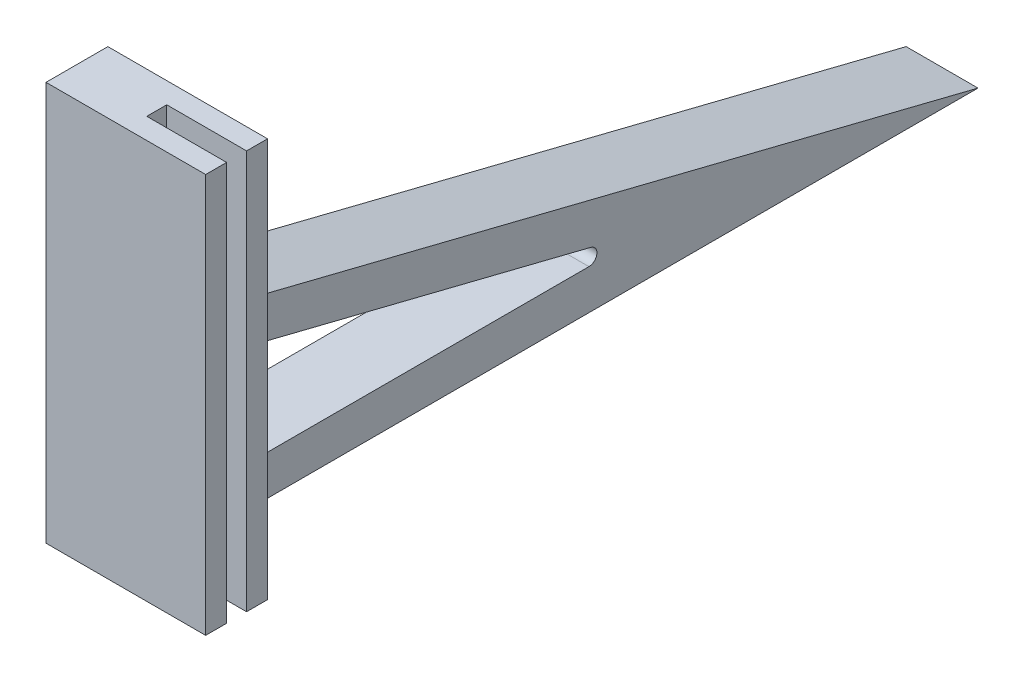
ISO-10303-21;
HEADER;
FILE_DESCRIPTION(('STEP AP214'),'2;1');
FILE_NAME('part.step','',(''),(''),'','','');
FILE_SCHEMA(('AUTOMOTIVE_DESIGN { 1 0 10303 214 1 1 1 1 }'));
ENDSEC;
DATA;
#1=APPLICATION_CONTEXT('core data for automotive mechanical design processes');
#2=APPLICATION_PROTOCOL_DEFINITION('international standard','automotive_design',2000,#1);
#3=PRODUCT_CONTEXT('',#1,'mechanical');
#4=PRODUCT('Part','Part','',(#3));
#5=PRODUCT_RELATED_PRODUCT_CATEGORY('part','',(#4));
#6=PRODUCT_DEFINITION_FORMATION('','',#4);
#7=PRODUCT_DEFINITION_CONTEXT('part definition',#1,'design');
#8=PRODUCT_DEFINITION('design','',#6,#7);
#9=PRODUCT_DEFINITION_SHAPE('','',#8);
#10=(LENGTH_UNIT() NAMED_UNIT(*) SI_UNIT(.MILLI.,.METRE.));
#11=(NAMED_UNIT(*) PLANE_ANGLE_UNIT() SI_UNIT($,.RADIAN.));
#12=(NAMED_UNIT(*) SI_UNIT($,.STERADIAN.) SOLID_ANGLE_UNIT());
#13=UNCERTAINTY_MEASURE_WITH_UNIT(LENGTH_MEASURE(1.E-05),#10,'distance_accuracy_value','');
#14=(GEOMETRIC_REPRESENTATION_CONTEXT(3) GLOBAL_UNCERTAINTY_ASSIGNED_CONTEXT((#13)) GLOBAL_UNIT_ASSIGNED_CONTEXT((#10,
#11,#12)) REPRESENTATION_CONTEXT('',''));
#15=CARTESIAN_POINT('',(0.,0.,0.));
#16=DIRECTION('',(0.,0.,1.));
#17=DIRECTION('',(1.,0.,0.));
#18=AXIS2_PLACEMENT_3D('',#15,#16,#17);
#19=CARTESIAN_POINT('',(0.,100.,0.));
#20=DIRECTION('',(-1.,0.,0.));
#21=DIRECTION('',(0.,0.,1.));
#22=AXIS2_PLACEMENT_3D('',#19,#20,#21);
#23=PLANE('',#22);
#24=DIRECTION('',(0.,0.,-1.));
#25=VECTOR('',#24,1.);
#26=CARTESIAN_POINT('',(0.,0.,0.));
#27=LINE('',#26,#25);
#28=CARTESIAN_POINT('',(0.,0.,0.));
#29=VERTEX_POINT('',#28);
#30=CARTESIAN_POINT('',(0.,0.,-5.));
#31=VERTEX_POINT('',#30);
#32=EDGE_CURVE('E194',#29,#31,#27,.T.);
#33=ORIENTED_EDGE('',*,*,#32,.T.);
#34=DIRECTION('',(0.,-1.,0.));
#35=VECTOR('',#34,1.);
#36=CARTESIAN_POINT('',(0.,100.,-5.));
#37=LINE('',#36,#35);
#38=CARTESIAN_POINT('',(0.,100.,-5.));
#39=VERTEX_POINT('',#38);
#40=EDGE_CURVE('E249',#39,#31,#37,.T.);
#41=ORIENTED_EDGE('',*,*,#40,.F.);
#42=DIRECTION('',(0.,0.,-1.));
#43=VECTOR('',#42,1.);
#44=CARTESIAN_POINT('',(0.,100.,0.));
#45=LINE('',#44,#43);
#46=CARTESIAN_POINT('',(0.,100.,0.));
#47=VERTEX_POINT('',#46);
#48=EDGE_CURVE('E195',#47,#39,#45,.T.);
#49=ORIENTED_EDGE('',*,*,#48,.F.);
#50=DIRECTION('',(0.,-1.,0.));
#51=VECTOR('',#50,1.);
#52=CARTESIAN_POINT('',(0.,100.,0.));
#53=LINE('',#52,#51);
#54=EDGE_CURVE('E213',#47,#29,#53,.T.);
#55=ORIENTED_EDGE('',*,*,#54,.T.);
#56=EDGE_LOOP('',(#33,#41,#49,#55));
#57=FACE_BOUND('',#56,.T.);
#58=ADVANCED_FACE('F33',(#57),#23,.F.);
#59=CARTESIAN_POINT('',(0.,100.,-5.));
#60=DIRECTION('',(0.,0.,-1.));
#61=DIRECTION('',(-1.,0.,0.));
#62=AXIS2_PLACEMENT_3D('',#59,#60,#61);
#63=PLANE('',#62);
#64=CARTESIAN_POINT('',(9.99999999999979,50.,-5.));
#65=DIRECTION('',(0.,0.,-1.));
#66=DIRECTION('',(-1.,0.,0.));
#67=AXIS2_PLACEMENT_3D('',#64,#65,#66);
#68=CIRCLE('',#67,2.5);
#69=CARTESIAN_POINT('',(7.49999999999979,50.,-5.));
#70=VERTEX_POINT('',#69);
#71=EDGE_CURVE('E190',#70,#70,#68,.F.);
#72=ORIENTED_EDGE('',*,*,#71,.F.);
#73=EDGE_LOOP('',(#72));
#74=FACE_BOUND('',#73,.T.);
#75=DIRECTION('',(1.,0.,0.));
#76=VECTOR('',#75,1.);
#77=CARTESIAN_POINT('',(0.,0.,-5.));
#78=LINE('',#77,#76);
#79=CARTESIAN_POINT('',(20.,0.,-5.));
#80=VERTEX_POINT('',#79);
#81=EDGE_CURVE('E216',#31,#80,#78,.T.);
#82=ORIENTED_EDGE('',*,*,#81,.T.);
#83=DIRECTION('',(0.,-1.,0.));
#84=VECTOR('',#83,1.);
#85=CARTESIAN_POINT('',(20.,100.,-5.));
#86=LINE('',#85,#84);
#87=CARTESIAN_POINT('',(20.,100.,-5.));
#88=VERTEX_POINT('',#87);
#89=EDGE_CURVE('E246',#88,#80,#86,.T.);
#90=ORIENTED_EDGE('',*,*,#89,.F.);
#91=DIRECTION('',(1.,0.,0.));
#92=VECTOR('',#91,1.);
#93=CARTESIAN_POINT('',(0.,100.,-5.));
#94=LINE('',#93,#92);
#95=EDGE_CURVE('E198',#39,#88,#94,.T.);
#96=ORIENTED_EDGE('',*,*,#95,.F.);
#97=ORIENTED_EDGE('',*,*,#40,.T.);
#98=EDGE_LOOP('',(#82,#90,#96,#97));
#99=FACE_BOUND('',#98,.T.);
#100=ADVANCED_FACE('F312',(#74,#99),#63,.F.);
#101=CARTESIAN_POINT('',(20.,100.,-5.));
#102=DIRECTION('',(-1.,0.,0.));
#103=DIRECTION('',(0.,0.,1.));
#104=AXIS2_PLACEMENT_3D('',#101,#102,#103);
#105=PLANE('',#104);
#106=DIRECTION('',(0.,0.,-1.));
#107=VECTOR('',#106,1.);
#108=CARTESIAN_POINT('',(20.,0.,-5.));
#109=LINE('',#108,#107);
#110=CARTESIAN_POINT('',(20.,0.,-10.25));
#111=VERTEX_POINT('',#110);
#112=EDGE_CURVE('E218',#80,#111,#109,.T.);
#113=ORIENTED_EDGE('',*,*,#112,.T.);
#114=DIRECTION('',(0.,-1.,0.));
#115=VECTOR('',#114,1.);
#116=CARTESIAN_POINT('',(20.,100.,-10.25));
#117=LINE('',#116,#115);
#118=CARTESIAN_POINT('',(20.,100.,-10.25));
#119=VERTEX_POINT('',#118);
#120=EDGE_CURVE('E243',#119,#111,#117,.T.);
#121=ORIENTED_EDGE('',*,*,#120,.F.);
#122=DIRECTION('',(0.,0.,-1.));
#123=VECTOR('',#122,1.);
#124=CARTESIAN_POINT('',(20.,100.,-5.));
#125=LINE('',#124,#123);
#126=EDGE_CURVE('E201',#88,#119,#125,.T.);
#127=ORIENTED_EDGE('',*,*,#126,.F.);
#128=ORIENTED_EDGE('',*,*,#89,.T.);
#129=EDGE_LOOP('',(#113,#121,#127,#128));
#130=FACE_BOUND('',#129,.T.);
#131=ADVANCED_FACE('F318',(#130),#105,.F.);
#132=CARTESIAN_POINT('',(20.,100.,-10.25));
#133=DIRECTION('',(0.,0.,1.));
#134=DIRECTION('',(1.,0.,0.));
#135=AXIS2_PLACEMENT_3D('',#132,#133,#134);
#136=PLANE('',#135);
#137=CARTESIAN_POINT('',(9.99999999999979,50.,-10.25));
#138=DIRECTION('',(0.,0.,-1.));
#139=DIRECTION('',(-1.,0.,0.));
#140=AXIS2_PLACEMENT_3D('',#137,#138,#139);
#141=CIRCLE('',#140,2.5);
#142=CARTESIAN_POINT('',(7.49999999999979,50.,-10.25));
#143=VERTEX_POINT('',#142);
#144=EDGE_CURVE('E504',#143,#143,#141,.T.);
#145=ORIENTED_EDGE('',*,*,#144,.F.);
#146=EDGE_LOOP('',(#145));
#147=FACE_BOUND('',#146,.T.);
#148=DIRECTION('',(0.,-1.,0.));
#149=VECTOR('',#148,1.);
#150=CARTESIAN_POINT('',(-20.,100.,-10.25));
#151=LINE('',#150,#149);
#152=CARTESIAN_POINT('',(-20.,37.130683123147,-10.25));
#153=VERTEX_POINT('',#152);
#154=CARTESIAN_POINT('',(-20.,13.,-10.25));
#155=VERTEX_POINT('',#154);
#156=EDGE_CURVE('E239',#153,#155,#151,.T.);
#157=ORIENTED_EDGE('',*,*,#156,.F.);
#158=DIRECTION('',(1.,0.,0.));
#159=VECTOR('',#158,1.);
#160=CARTESIAN_POINT('',(20.,37.130683123147,-10.25));
#161=LINE('',#160,#159);
#162=CARTESIAN_POINT('',(-2.00000000000001,37.130683123147,-10.25));
#163=VERTEX_POINT('',#162);
#164=EDGE_CURVE('E269',#153,#163,#161,.T.);
#165=ORIENTED_EDGE('',*,*,#164,.T.);
#166=DIRECTION('',(0.,1.,0.));
#167=VECTOR('',#166,1.);
#168=CARTESIAN_POINT('',(-2.00000000000001,100.,-10.25));
#169=LINE('',#168,#167);
#170=CARTESIAN_POINT('',(-2.00000000000001,52.3423292192133,-10.25));
#171=VERTEX_POINT('',#170);
#172=EDGE_CURVE('E172',#163,#171,#169,.T.);
#173=ORIENTED_EDGE('',*,*,#172,.T.);
#174=DIRECTION('',(-1.,0.,0.));
#175=VECTOR('',#174,1.);
#176=CARTESIAN_POINT('',(-20.,52.3423292192133,-10.25));
#177=LINE('',#176,#175);
#178=CARTESIAN_POINT('',(-20.,52.3423292192133,-10.25));
#179=VERTEX_POINT('',#178);
#180=EDGE_CURVE('E252',#171,#179,#177,.T.);
#181=ORIENTED_EDGE('',*,*,#180,.T.);
#182=CARTESIAN_POINT('',(-20.,100.,-10.25));
#183=VERTEX_POINT('',#182);
#184=EDGE_CURVE('E240',#183,#179,#151,.T.);
#185=ORIENTED_EDGE('',*,*,#184,.F.);
#186=DIRECTION('',(-1.,0.,0.));
#187=VECTOR('',#186,1.);
#188=CARTESIAN_POINT('',(20.,100.,-10.25));
#189=LINE('',#188,#187);
#190=EDGE_CURVE('E203',#119,#183,#189,.T.);
#191=ORIENTED_EDGE('',*,*,#190,.F.);
#192=ORIENTED_EDGE('',*,*,#120,.T.);
#193=DIRECTION('',(-1.,0.,0.));
#194=VECTOR('',#193,1.);
#195=CARTESIAN_POINT('',(20.,0.,-10.25));
#196=LINE('',#195,#194);
#197=CARTESIAN_POINT('',(-2.,0.,-10.25));
#198=VERTEX_POINT('',#197);
#199=EDGE_CURVE('E220',#111,#198,#196,.T.);
#200=ORIENTED_EDGE('',*,*,#199,.T.);
#201=DIRECTION('',(0.,-1.,0.));
#202=VECTOR('',#201,1.);
#203=CARTESIAN_POINT('',(-2.00000000000001,10.,-10.25));
#204=LINE('',#203,#202);
#205=CARTESIAN_POINT('',(-2.00000000000001,13.,-10.25));
#206=VERTEX_POINT('',#205);
#207=EDGE_CURVE('E159',#206,#198,#204,.T.);
#208=ORIENTED_EDGE('',*,*,#207,.F.);
#209=DIRECTION('',(-1.,0.,0.));
#210=VECTOR('',#209,1.);
#211=CARTESIAN_POINT('',(20.,13.,-10.25));
#212=LINE('',#211,#210);
#213=EDGE_CURVE('E260',#206,#155,#212,.T.);
#214=ORIENTED_EDGE('',*,*,#213,.T.);
#215=EDGE_LOOP('',(#157,#165,#173,#181,#185,#191,#192,#200,#208,#214));
#216=FACE_BOUND('',#215,.T.);
#217=ADVANCED_FACE('F299',(#147,#216),#136,.F.);
#218=CARTESIAN_POINT('',(-20.,100.,5.25000000000001));
#219=DIRECTION('',(1.,0.,0.));
#220=DIRECTION('',(0.,0.,-1.));
#221=AXIS2_PLACEMENT_3D('',#218,#219,#220);
#222=PLANE('',#221);
#223=ORIENTED_EDGE('',*,*,#184,.T.);
#224=CARTESIAN_POINT('',(-20.,52.3423292192133,-13.25));
#225=DIRECTION('',(1.,0.,0.));
#226=DIRECTION('',(0.,0.,-1.));
#227=AXIS2_PLACEMENT_3D('',#224,#225,#226);
#228=CIRCLE('',#227,3.);
#229=CARTESIAN_POINT('',(-20.,49.4319017187773,-12.522393124891));
#230=VERTEX_POINT('',#229);
#231=EDGE_CURVE('E256',#179,#230,#228,.T.);
#232=ORIENTED_EDGE('',*,*,#231,.T.);
#233=DIRECTION('',(0.,0.242535625036333,0.970142500145332));
#234=VECTOR('',#233,1.);
#235=CARTESIAN_POINT('',(-20.,0.,-210.25));
#236=LINE('',#235,#234);
#237=CARTESIAN_POINT('',(-20.,0.,-210.25));
#238=VERTEX_POINT('',#237);
#239=EDGE_CURVE('E189',#238,#230,#236,.T.);
#240=ORIENTED_EDGE('',*,*,#239,.F.);
#241=DIRECTION('',(0.,0.,1.));
#242=VECTOR('',#241,1.);
#243=CARTESIAN_POINT('',(-20.,0.,5.25000000000001));
#244=LINE('',#243,#242);
#245=CARTESIAN_POINT('',(-20.,0.,5.25000000000001));
#246=VERTEX_POINT('',#245);
#247=EDGE_CURVE('E168',#238,#246,#244,.T.);
#248=ORIENTED_EDGE('',*,*,#247,.T.);
#249=DIRECTION('',(0.,-1.,0.));
#250=VECTOR('',#249,1.);
#251=CARTESIAN_POINT('',(-20.,100.,5.25000000000001));
#252=LINE('',#251,#250);
#253=CARTESIAN_POINT('',(-20.,100.,5.25000000000001));
#254=VERTEX_POINT('',#253);
#255=EDGE_CURVE('E236',#254,#246,#252,.T.);
#256=ORIENTED_EDGE('',*,*,#255,.F.);
#257=DIRECTION('',(0.,0.,1.));
#258=VECTOR('',#257,1.);
#259=CARTESIAN_POINT('',(-20.,100.,5.25000000000001));
#260=LINE('',#259,#258);
#261=EDGE_CURVE('E205',#183,#254,#260,.T.);
#262=ORIENTED_EDGE('',*,*,#261,.F.);
#263=EDGE_LOOP('',(#223,#232,#240,#248,#256,#262));
#264=FACE_BOUND('',#263,.T.);
#265=DIRECTION('',(0.,0.,-1.));
#266=VECTOR('',#265,1.);
#267=CARTESIAN_POINT('',(-20.,10.,-10.25));
#268=LINE('',#267,#266);
#269=CARTESIAN_POINT('',(-20.,10.,-13.25));
#270=VERTEX_POINT('',#269);
#271=CARTESIAN_POINT('',(-20.,9.99999999999999,-112.772732492588));
#272=VERTEX_POINT('',#271);
#273=EDGE_CURVE('E180',#270,#272,#268,.T.);
#274=ORIENTED_EDGE('',*,*,#273,.T.);
#275=CARTESIAN_POINT('',(-20.,12.,-112.772732492588));
#276=DIRECTION('',(1.,0.,0.));
#277=DIRECTION('',(0.,0.,-1.));
#278=AXIS2_PLACEMENT_3D('',#275,#276,#277);
#279=CIRCLE('',#278,2.);
#280=CARTESIAN_POINT('',(-20.,13.9402850002907,-113.257803742661));
#281=VERTEX_POINT('',#280);
#282=EDGE_CURVE('E41',#272,#281,#279,.T.);
#283=ORIENTED_EDGE('',*,*,#282,.T.);
#284=DIRECTION('',(0.,0.242535625036333,0.970142500145332));
#285=VECTOR('',#284,1.);
#286=CARTESIAN_POINT('',(-20.,-9.70142500145334,-207.824643749637));
#287=LINE('',#286,#285);
#288=CARTESIAN_POINT('',(-20.,39.0709681234377,-12.7350712500727));
#289=VERTEX_POINT('',#288);
#290=EDGE_CURVE('E187',#281,#289,#287,.T.);
#291=ORIENTED_EDGE('',*,*,#290,.T.);
#292=CARTESIAN_POINT('',(-20.,37.130683123147,-12.25));
#293=DIRECTION('',(1.,0.,0.));
#294=DIRECTION('',(0.,0.,-1.));
#295=AXIS2_PLACEMENT_3D('',#292,#293,#294);
#296=CIRCLE('',#295,2.);
#297=EDGE_CURVE('E278',#289,#153,#296,.T.);
#298=ORIENTED_EDGE('',*,*,#297,.T.);
#299=ORIENTED_EDGE('',*,*,#156,.T.);
#300=CARTESIAN_POINT('',(-20.,13.,-13.25));
#301=DIRECTION('',(1.,0.,0.));
#302=DIRECTION('',(0.,0.,-1.));
#303=AXIS2_PLACEMENT_3D('',#300,#301,#302);
#304=CIRCLE('',#303,3.);
#305=EDGE_CURVE('E265',#155,#270,#304,.T.);
#306=ORIENTED_EDGE('',*,*,#305,.T.);
#307=EDGE_LOOP('',(#274,#283,#291,#298,#299,#306));
#308=FACE_BOUND('',#307,.T.);
#309=ADVANCED_FACE('F291',(#264,#308),#222,.F.);
#310=CARTESIAN_POINT('',(20.,100.,5.25));
#311=DIRECTION('',(0.,0.,-1.));
#312=DIRECTION('',(-1.,0.,0.));
#313=AXIS2_PLACEMENT_3D('',#310,#311,#312);
#314=PLANE('',#313);
#315=DIRECTION('',(1.,0.,0.));
#316=VECTOR('',#315,1.);
#317=CARTESIAN_POINT('',(20.,0.,5.25));
#318=LINE('',#317,#316);
#319=CARTESIAN_POINT('',(20.,0.,5.25));
#320=VERTEX_POINT('',#319);
#321=EDGE_CURVE('E223',#246,#320,#318,.T.);
#322=ORIENTED_EDGE('',*,*,#321,.T.);
#323=DIRECTION('',(0.,-1.,0.));
#324=VECTOR('',#323,1.);
#325=CARTESIAN_POINT('',(20.,100.,5.25));
#326=LINE('',#325,#324);
#327=CARTESIAN_POINT('',(20.,100.,5.25));
#328=VERTEX_POINT('',#327);
#329=EDGE_CURVE('E233',#328,#320,#326,.T.);
#330=ORIENTED_EDGE('',*,*,#329,.F.);
#331=DIRECTION('',(1.,0.,0.));
#332=VECTOR('',#331,1.);
#333=CARTESIAN_POINT('',(20.,100.,5.25));
#334=LINE('',#333,#332);
#335=EDGE_CURVE('E207',#254,#328,#334,.T.);
#336=ORIENTED_EDGE('',*,*,#335,.F.);
#337=ORIENTED_EDGE('',*,*,#255,.T.);
#338=EDGE_LOOP('',(#322,#330,#336,#337));
#339=FACE_BOUND('',#338,.T.);
#340=ADVANCED_FACE('F347',(#339),#314,.F.);
#341=CARTESIAN_POINT('',(20.,100.,0.));
#342=DIRECTION('',(-1.,0.,0.));
#343=DIRECTION('',(0.,0.,1.));
#344=AXIS2_PLACEMENT_3D('',#341,#342,#343);
#345=PLANE('',#344);
#346=DIRECTION('',(0.,0.,-1.));
#347=VECTOR('',#346,1.);
#348=CARTESIAN_POINT('',(20.,0.,0.));
#349=LINE('',#348,#347);
#350=CARTESIAN_POINT('',(20.,0.,0.));
#351=VERTEX_POINT('',#350);
#352=EDGE_CURVE('E225',#320,#351,#349,.T.);
#353=ORIENTED_EDGE('',*,*,#352,.T.);
#354=DIRECTION('',(0.,-1.,0.));
#355=VECTOR('',#354,1.);
#356=CARTESIAN_POINT('',(20.,100.,0.));
#357=LINE('',#356,#355);
#358=CARTESIAN_POINT('',(20.,100.,0.));
#359=VERTEX_POINT('',#358);
#360=EDGE_CURVE('E230',#359,#351,#357,.T.);
#361=ORIENTED_EDGE('',*,*,#360,.F.);
#362=DIRECTION('',(0.,0.,-1.));
#363=VECTOR('',#362,1.);
#364=CARTESIAN_POINT('',(20.,100.,0.));
#365=LINE('',#364,#363);
#366=EDGE_CURVE('E209',#328,#359,#365,.T.);
#367=ORIENTED_EDGE('',*,*,#366,.F.);
#368=ORIENTED_EDGE('',*,*,#329,.T.);
#369=EDGE_LOOP('',(#353,#361,#367,#368));
#370=FACE_BOUND('',#369,.T.);
#371=ADVANCED_FACE('F421',(#370),#345,.F.);
#372=CARTESIAN_POINT('',(0.,100.,0.));
#373=DIRECTION('',(0.,0.,1.));
#374=DIRECTION('',(1.,0.,0.));
#375=AXIS2_PLACEMENT_3D('',#372,#373,#374);
#376=PLANE('',#375);
#377=DIRECTION('',(-1.,0.,0.));
#378=VECTOR('',#377,1.);
#379=CARTESIAN_POINT('',(0.,0.,0.));
#380=LINE('',#379,#378);
#381=EDGE_CURVE('E199',#351,#29,#380,.T.);
#382=ORIENTED_EDGE('',*,*,#381,.T.);
#383=ORIENTED_EDGE('',*,*,#54,.F.);
#384=DIRECTION('',(-1.,0.,0.));
#385=VECTOR('',#384,1.);
#386=CARTESIAN_POINT('',(0.,100.,0.));
#387=LINE('',#386,#385);
#388=EDGE_CURVE('E211',#359,#47,#387,.T.);
#389=ORIENTED_EDGE('',*,*,#388,.F.);
#390=ORIENTED_EDGE('',*,*,#360,.T.);
#391=EDGE_LOOP('',(#382,#383,#389,#390));
#392=FACE_BOUND('',#391,.T.);
#393=ADVANCED_FACE('F431',(#392),#376,.F.);
#394=CARTESIAN_POINT('',(0.,100.,0.));
#395=DIRECTION('',(0.,-1.,0.));
#396=DIRECTION('',(0.,0.,-1.));
#397=AXIS2_PLACEMENT_3D('',#394,#395,#396);
#398=PLANE('',#397);
#399=ORIENTED_EDGE('',*,*,#48,.T.);
#400=ORIENTED_EDGE('',*,*,#95,.T.);
#401=ORIENTED_EDGE('',*,*,#126,.T.);
#402=ORIENTED_EDGE('',*,*,#190,.T.);
#403=ORIENTED_EDGE('',*,*,#261,.T.);
#404=ORIENTED_EDGE('',*,*,#335,.T.);
#405=ORIENTED_EDGE('',*,*,#366,.T.);
#406=ORIENTED_EDGE('',*,*,#388,.T.);
#407=EDGE_LOOP('',(#399,#400,#401,#402,#403,#404,#405,#406));
#408=FACE_BOUND('',#407,.T.);
#409=ADVANCED_FACE('F441',(#408),#398,.F.);
#410=CARTESIAN_POINT('',(0.,0.,0.));
#411=DIRECTION('',(0.,-1.,0.));
#412=DIRECTION('',(0.,0.,-1.));
#413=AXIS2_PLACEMENT_3D('',#410,#411,#412);
#414=PLANE('',#413);
#415=ORIENTED_EDGE('',*,*,#32,.F.);
#416=ORIENTED_EDGE('',*,*,#381,.F.);
#417=ORIENTED_EDGE('',*,*,#352,.F.);
#418=ORIENTED_EDGE('',*,*,#321,.F.);
#419=ORIENTED_EDGE('',*,*,#247,.F.);
#420=DIRECTION('',(-1.,0.,0.));
#421=VECTOR('',#420,1.);
#422=CARTESIAN_POINT('',(-2.00000000000005,0.,-210.25));
#423=LINE('',#422,#421);
#424=CARTESIAN_POINT('',(-2.00000000000005,0.,-210.25));
#425=VERTEX_POINT('',#424);
#426=EDGE_CURVE('E164',#425,#238,#423,.T.);
#427=ORIENTED_EDGE('',*,*,#426,.F.);
#428=DIRECTION('',(0.,0.,-1.));
#429=VECTOR('',#428,1.);
#430=CARTESIAN_POINT('',(-2.00000000000001,0.,-10.25));
#431=LINE('',#430,#429);
#432=EDGE_CURVE('E151',#198,#425,#431,.T.);
#433=ORIENTED_EDGE('',*,*,#432,.F.);
#434=ORIENTED_EDGE('',*,*,#199,.F.);
#435=ORIENTED_EDGE('',*,*,#112,.F.);
#436=ORIENTED_EDGE('',*,*,#81,.F.);
#437=EDGE_LOOP('',(#415,#416,#417,#418,#419,#427,#433,#434,#435,#436));
#438=FACE_BOUND('',#437,.T.);
#439=ADVANCED_FACE('F166',(#438),#414,.T.);
#440=CARTESIAN_POINT('',(-2.00000000000005,-9.70142500145334,-207.824643749637));
#441=DIRECTION('',(0.,-0.970142500145332,0.242535625036333));
#442=DIRECTION('',(0.,-0.242535625036333,-0.970142500145332));
#443=AXIS2_PLACEMENT_3D('',#440,#441,#442);
#444=PLANE('',#443);
#445=ORIENTED_EDGE('',*,*,#290,.F.);
#446=DIRECTION('',(-1.,0.,0.));
#447=VECTOR('',#446,1.);
#448=CARTESIAN_POINT('',(-2.00000000000003,13.9402850002907,-113.257803742661));
#449=LINE('',#448,#447);
#450=CARTESIAN_POINT('',(-2.00000000000003,13.9402850002907,-113.257803742661));
#451=VERTEX_POINT('',#450);
#452=EDGE_CURVE('E54',#281,#451,#449,.F.);
#453=ORIENTED_EDGE('',*,*,#452,.T.);
#454=DIRECTION('',(0.,0.242535625036333,0.970142500145332));
#455=VECTOR('',#454,1.);
#456=CARTESIAN_POINT('',(-2.00000000000005,-9.70142500145334,-207.824643749637));
#457=LINE('',#456,#455);
#458=CARTESIAN_POINT('',(-2.00000000000001,39.0709681234377,-12.7350712500727));
#459=VERTEX_POINT('',#458);
#460=EDGE_CURVE('E178',#451,#459,#457,.T.);
#461=ORIENTED_EDGE('',*,*,#460,.T.);
#462=DIRECTION('',(1.,0.,0.));
#463=VECTOR('',#462,1.);
#464=CARTESIAN_POINT('',(-2.00000000000003,39.0709681234377,-12.7350712500727));
#465=LINE('',#464,#463);
#466=EDGE_CURVE('E272',#459,#289,#465,.F.);
#467=ORIENTED_EDGE('',*,*,#466,.T.);
#468=EDGE_LOOP('',(#445,#453,#461,#467));
#469=FACE_BOUND('',#468,.T.);
#470=ADVANCED_FACE('F358',(#469),#444,.T.);
#471=CARTESIAN_POINT('',(-2.,0.,0.));
#472=DIRECTION('',(1.,0.,0.));
#473=DIRECTION('',(0.,0.,-1.));
#474=AXIS2_PLACEMENT_3D('',#471,#472,#473);
#475=PLANE('',#474);
#476=ORIENTED_EDGE('',*,*,#172,.F.);
#477=CARTESIAN_POINT('',(-2.00000000000001,37.130683123147,-12.25));
#478=DIRECTION('',(1.,0.,0.));
#479=DIRECTION('',(0.,0.,-1.));
#480=AXIS2_PLACEMENT_3D('',#477,#478,#479);
#481=CIRCLE('',#480,2.);
#482=EDGE_CURVE('E275',#163,#459,#481,.F.);
#483=ORIENTED_EDGE('',*,*,#482,.T.);
#484=ORIENTED_EDGE('',*,*,#460,.F.);
#485=CARTESIAN_POINT('',(-2.00000000000003,12.,-112.772732492588));
#486=DIRECTION('',(1.,0.,0.));
#487=DIRECTION('',(0.,0.,-1.));
#488=AXIS2_PLACEMENT_3D('',#485,#486,#487);
#489=CIRCLE('',#488,2.);
#490=CARTESIAN_POINT('',(-2.00000000000003,9.99999999999999,-112.772732492588));
#491=VERTEX_POINT('',#490);
#492=EDGE_CURVE('E11',#451,#491,#489,.F.);
#493=ORIENTED_EDGE('',*,*,#492,.T.);
#494=DIRECTION('',(0.,0.,-1.));
#495=VECTOR('',#494,1.);
#496=CARTESIAN_POINT('',(-2.00000000000001,10.,-10.25));
#497=LINE('',#496,#495);
#498=CARTESIAN_POINT('',(-2.00000000000001,10.,-13.25));
#499=VERTEX_POINT('',#498);
#500=EDGE_CURVE('E173',#499,#491,#497,.T.);
#501=ORIENTED_EDGE('',*,*,#500,.F.);
#502=CARTESIAN_POINT('',(-2.00000000000001,13.,-13.25));
#503=DIRECTION('',(1.,0.,0.));
#504=DIRECTION('',(0.,0.,-1.));
#505=AXIS2_PLACEMENT_3D('',#502,#503,#504);
#506=CIRCLE('',#505,3.);
#507=EDGE_CURVE('E267',#499,#206,#506,.F.);
#508=ORIENTED_EDGE('',*,*,#507,.T.);
#509=ORIENTED_EDGE('',*,*,#207,.T.);
#510=ORIENTED_EDGE('',*,*,#432,.T.);
#511=DIRECTION('',(0.,0.242535625036333,0.970142500145332));
#512=VECTOR('',#511,1.);
#513=CARTESIAN_POINT('',(-2.00000000000005,0.,-210.25));
#514=LINE('',#513,#512);
#515=CARTESIAN_POINT('',(-2.00000000000001,49.4319017187773,-12.522393124891));
#516=VERTEX_POINT('',#515);
#517=EDGE_CURVE('E156',#425,#516,#514,.T.);
#518=ORIENTED_EDGE('',*,*,#517,.T.);
#519=CARTESIAN_POINT('',(-2.00000000000001,52.3423292192133,-13.25));
#520=DIRECTION('',(1.,0.,0.));
#521=DIRECTION('',(0.,0.,-1.));
#522=AXIS2_PLACEMENT_3D('',#519,#520,#521);
#523=CIRCLE('',#522,3.);
#524=EDGE_CURVE('E258',#516,#171,#523,.F.);
#525=ORIENTED_EDGE('',*,*,#524,.T.);
#526=EDGE_LOOP('',(#476,#483,#484,#493,#501,#508,#509,#510,#518,#525));
#527=FACE_BOUND('',#526,.T.);
#528=ADVANCED_FACE('F153',(#527),#475,.T.);
#529=CARTESIAN_POINT('',(-2.00000000000001,10.,-10.25));
#530=DIRECTION('',(0.,1.,0.));
#531=DIRECTION('',(0.,0.,1.));
#532=AXIS2_PLACEMENT_3D('',#529,#530,#531);
#533=PLANE('',#532);
#534=ORIENTED_EDGE('',*,*,#500,.T.);
#535=DIRECTION('',(-1.,0.,0.));
#536=VECTOR('',#535,1.);
#537=CARTESIAN_POINT('',(-20.,9.99999999999999,-112.772732492588));
#538=LINE('',#537,#536);
#539=EDGE_CURVE('E280',#491,#272,#538,.T.);
#540=ORIENTED_EDGE('',*,*,#539,.T.);
#541=ORIENTED_EDGE('',*,*,#273,.F.);
#542=DIRECTION('',(-1.,0.,0.));
#543=VECTOR('',#542,1.);
#544=CARTESIAN_POINT('',(-2.00000000000001,10.,-13.25));
#545=LINE('',#544,#543);
#546=EDGE_CURVE('E263',#270,#499,#545,.F.);
#547=ORIENTED_EDGE('',*,*,#546,.T.);
#548=EDGE_LOOP('',(#534,#540,#541,#547));
#549=FACE_BOUND('',#548,.T.);
#550=ADVANCED_FACE('F286',(#549),#533,.T.);
#551=CARTESIAN_POINT('',(-2.00000000000005,0.,-210.25));
#552=DIRECTION('',(0.,-0.970142500145332,0.242535625036333));
#553=DIRECTION('',(0.,-0.242535625036333,-0.970142500145332));
#554=AXIS2_PLACEMENT_3D('',#551,#552,#553);
#555=PLANE('',#554);
#556=ORIENTED_EDGE('',*,*,#239,.T.);
#557=DIRECTION('',(-1.,0.,0.));
#558=VECTOR('',#557,1.);
#559=CARTESIAN_POINT('',(-2.00000000000001,49.4319017187773,-12.522393124891));
#560=LINE('',#559,#558);
#561=EDGE_CURVE('E177',#230,#516,#560,.F.);
#562=ORIENTED_EDGE('',*,*,#561,.T.);
#563=ORIENTED_EDGE('',*,*,#517,.F.);
#564=ORIENTED_EDGE('',*,*,#426,.T.);
#565=EDGE_LOOP('',(#556,#562,#563,#564));
#566=FACE_BOUND('',#565,.T.);
#567=ADVANCED_FACE('F175',(#566),#555,.F.);
#568=CARTESIAN_POINT('',(20.,52.3423292192133,-13.25));
#569=DIRECTION('',(1.,0.,0.));
#570=DIRECTION('',(0.,0.,-1.));
#571=AXIS2_PLACEMENT_3D('',#568,#569,#570);
#572=CYLINDRICAL_SURFACE('',#571,3.);
#573=ORIENTED_EDGE('',*,*,#524,.F.);
#574=ORIENTED_EDGE('',*,*,#561,.F.);
#575=ORIENTED_EDGE('',*,*,#231,.F.);
#576=ORIENTED_EDGE('',*,*,#180,.F.);
#577=EDGE_LOOP('',(#573,#574,#575,#576));
#578=FACE_BOUND('',#577,.T.);
#579=ADVANCED_FACE('F323',(#578),#572,.F.);
#580=CARTESIAN_POINT('',(20.,13.,-13.25));
#581=DIRECTION('',(-1.,0.,0.));
#582=DIRECTION('',(0.,0.,1.));
#583=AXIS2_PLACEMENT_3D('',#580,#581,#582);
#584=CYLINDRICAL_SURFACE('',#583,3.);
#585=ORIENTED_EDGE('',*,*,#507,.F.);
#586=ORIENTED_EDGE('',*,*,#546,.F.);
#587=ORIENTED_EDGE('',*,*,#305,.F.);
#588=ORIENTED_EDGE('',*,*,#213,.F.);
#589=EDGE_LOOP('',(#585,#586,#587,#588));
#590=FACE_BOUND('',#589,.T.);
#591=ADVANCED_FACE('F297',(#590),#584,.F.);
#592=CARTESIAN_POINT('',(20.,37.130683123147,-12.25));
#593=DIRECTION('',(1.,0.,0.));
#594=DIRECTION('',(0.,0.,-1.));
#595=AXIS2_PLACEMENT_3D('',#592,#593,#594);
#596=CYLINDRICAL_SURFACE('',#595,2.);
#597=ORIENTED_EDGE('',*,*,#297,.F.);
#598=ORIENTED_EDGE('',*,*,#466,.F.);
#599=ORIENTED_EDGE('',*,*,#482,.F.);
#600=ORIENTED_EDGE('',*,*,#164,.F.);
#601=EDGE_LOOP('',(#597,#598,#599,#600));
#602=FACE_BOUND('',#601,.T.);
#603=ADVANCED_FACE('F303',(#602),#596,.F.);
#604=CARTESIAN_POINT('',(-2.00000000000003,12.,-112.772732492588));
#605=DIRECTION('',(1.,0.,0.));
#606=DIRECTION('',(0.,0.,-1.));
#607=AXIS2_PLACEMENT_3D('',#604,#605,#606);
#608=CYLINDRICAL_SURFACE('',#607,2.);
#609=ORIENTED_EDGE('',*,*,#492,.F.);
#610=ORIENTED_EDGE('',*,*,#452,.F.);
#611=ORIENTED_EDGE('',*,*,#282,.F.);
#612=ORIENTED_EDGE('',*,*,#539,.F.);
#613=EDGE_LOOP('',(#609,#610,#611,#612));
#614=FACE_BOUND('',#613,.T.);
#615=ADVANCED_FACE('F35',(#614),#608,.F.);
#616=CARTESIAN_POINT('',(9.99999999999979,50.,5.25100000000001));
#617=DIRECTION('',(0.,0.,-1.));
#618=DIRECTION('',(-1.,0.,0.));
#619=AXIS2_PLACEMENT_3D('',#616,#617,#618);
#620=CYLINDRICAL_SURFACE('',#619,2.5);
#621=ORIENTED_EDGE('',*,*,#144,.T.);
#622=EDGE_LOOP('',(#621));
#623=FACE_BOUND('',#622,.T.);
#624=ORIENTED_EDGE('',*,*,#71,.T.);
#625=EDGE_LOOP('',(#624));
#626=FACE_BOUND('',#625,.T.);
#627=ADVANCED_FACE('F302',(#623,#626),#620,.F.);
#628=CLOSED_SHELL('',(#58,#100,#131,#217,#309,#340,#371,#393,#409,#439,#470,#528,#550,#567,#579,
#591,#603,#615,#627));
#629=MANIFOLD_SOLID_BREP('B2',#628);
#630=ADVANCED_BREP_SHAPE_REPRESENTATION('',(#18,#629),#14);
#631=SHAPE_DEFINITION_REPRESENTATION(#9,#630);
ENDSEC;
END-ISO-10303-21;
